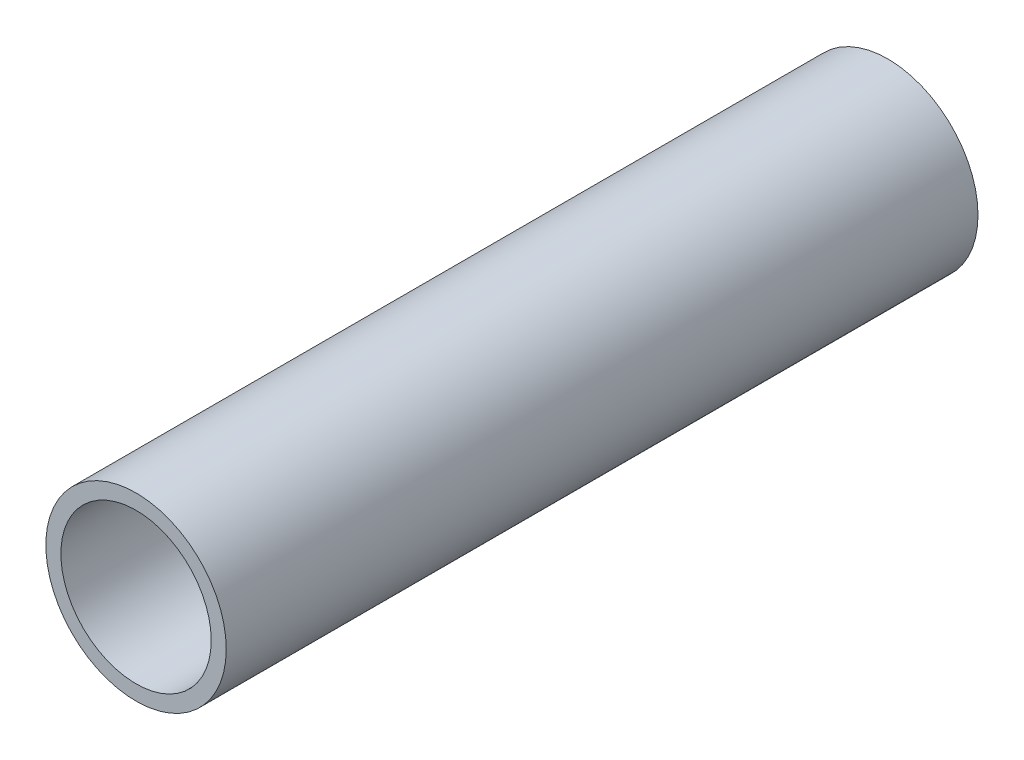
ISO-10303-21;
HEADER;
FILE_DESCRIPTION(('STEP AP214'),'2;1');
FILE_NAME('part.step','',(''),(''),'','','');
FILE_SCHEMA(('AUTOMOTIVE_DESIGN { 1 0 10303 214 1 1 1 1 }'));
ENDSEC;
DATA;
#1=APPLICATION_CONTEXT('core data for automotive mechanical design processes');
#2=APPLICATION_PROTOCOL_DEFINITION('international standard','automotive_design',2000,#1);
#3=PRODUCT_CONTEXT('',#1,'mechanical');
#4=PRODUCT('Part','Part','',(#3));
#5=PRODUCT_RELATED_PRODUCT_CATEGORY('part','',(#4));
#6=PRODUCT_DEFINITION_FORMATION('','',#4);
#7=PRODUCT_DEFINITION_CONTEXT('part definition',#1,'design');
#8=PRODUCT_DEFINITION('design','',#6,#7);
#9=PRODUCT_DEFINITION_SHAPE('','',#8);
#10=(LENGTH_UNIT() NAMED_UNIT(*) SI_UNIT(.MILLI.,.METRE.));
#11=(NAMED_UNIT(*) PLANE_ANGLE_UNIT() SI_UNIT($,.RADIAN.));
#12=(NAMED_UNIT(*) SI_UNIT($,.STERADIAN.) SOLID_ANGLE_UNIT());
#13=UNCERTAINTY_MEASURE_WITH_UNIT(LENGTH_MEASURE(1.E-05),#10,'distance_accuracy_value','');
#14=(GEOMETRIC_REPRESENTATION_CONTEXT(3) GLOBAL_UNCERTAINTY_ASSIGNED_CONTEXT((#13)) GLOBAL_UNIT_ASSIGNED_CONTEXT((#10,
#11,#12)) REPRESENTATION_CONTEXT('',''));
#15=CARTESIAN_POINT('',(0.,0.,0.));
#16=DIRECTION('',(0.,0.,1.));
#17=DIRECTION('',(1.,0.,0.));
#18=AXIS2_PLACEMENT_3D('',#15,#16,#17);
#19=CARTESIAN_POINT('',(0.,0.,500.));
#20=DIRECTION('',(0.,0.,1.));
#21=DIRECTION('',(1.,0.,0.));
#22=AXIS2_PLACEMENT_3D('',#19,#20,#21);
#23=PLANE('',#22);
#24=CARTESIAN_POINT('',(0.,0.,500.));
#25=DIRECTION('',(0.,0.,1.));
#26=DIRECTION('',(1.,0.,0.));
#27=AXIS2_PLACEMENT_3D('',#24,#25,#26);
#28=CIRCLE('',#27,60.);
#29=CARTESIAN_POINT('',(60.,0.,500.));
#30=VERTEX_POINT('',#29);
#31=EDGE_CURVE('E10',#30,#30,#28,.T.);
#32=ORIENTED_EDGE('',*,*,#31,.T.);
#33=EDGE_LOOP('',(#32));
#34=FACE_BOUND('',#33,.T.);
#35=CARTESIAN_POINT('',(0.,0.,500.));
#36=DIRECTION('',(0.,0.,1.));
#37=DIRECTION('',(1.,0.,0.));
#38=AXIS2_PLACEMENT_3D('',#35,#36,#37);
#39=CIRCLE('',#38,50.);
#40=CARTESIAN_POINT('',(50.,0.,500.));
#41=VERTEX_POINT('',#40);
#42=EDGE_CURVE('E50',#41,#41,#39,.T.);
#43=ORIENTED_EDGE('',*,*,#42,.F.);
#44=EDGE_LOOP('',(#43));
#45=FACE_BOUND('',#44,.T.);
#46=ADVANCED_FACE('F37',(#34,#45),#23,.T.);
#47=CARTESIAN_POINT('',(0.,0.,0.));
#48=DIRECTION('',(0.,0.,1.));
#49=DIRECTION('',(1.,0.,0.));
#50=AXIS2_PLACEMENT_3D('',#47,#48,#49);
#51=PLANE('',#50);
#52=CARTESIAN_POINT('',(0.,0.,0.));
#53=DIRECTION('',(0.,0.,1.));
#54=DIRECTION('',(1.,0.,0.));
#55=AXIS2_PLACEMENT_3D('',#52,#53,#54);
#56=CIRCLE('',#55,60.);
#57=CARTESIAN_POINT('',(60.,0.,0.));
#58=VERTEX_POINT('',#57);
#59=EDGE_CURVE('E41',#58,#58,#56,.T.);
#60=ORIENTED_EDGE('',*,*,#59,.F.);
#61=EDGE_LOOP('',(#60));
#62=FACE_BOUND('',#61,.T.);
#63=CARTESIAN_POINT('',(0.,0.,0.));
#64=DIRECTION('',(0.,0.,1.));
#65=DIRECTION('',(1.,0.,0.));
#66=AXIS2_PLACEMENT_3D('',#63,#64,#65);
#67=CIRCLE('',#66,50.);
#68=CARTESIAN_POINT('',(50.,0.,0.));
#69=VERTEX_POINT('',#68);
#70=EDGE_CURVE('E52',#69,#69,#67,.T.);
#71=ORIENTED_EDGE('',*,*,#70,.T.);
#72=EDGE_LOOP('',(#71));
#73=FACE_BOUND('',#72,.T.);
#74=ADVANCED_FACE('F64',(#62,#73),#51,.F.);
#75=CARTESIAN_POINT('',(0.,0.,500.));
#76=DIRECTION('',(0.,0.,-1.));
#77=DIRECTION('',(-1.,0.,0.));
#78=AXIS2_PLACEMENT_3D('',#75,#76,#77);
#79=CYLINDRICAL_SURFACE('',#78,60.);
#80=ORIENTED_EDGE('',*,*,#31,.F.);
#81=EDGE_LOOP('',(#80));
#82=FACE_BOUND('',#81,.T.);
#83=ORIENTED_EDGE('',*,*,#59,.T.);
#84=EDGE_LOOP('',(#83));
#85=FACE_BOUND('',#84,.T.);
#86=ADVANCED_FACE('F39',(#82,#85),#79,.T.);
#87=CARTESIAN_POINT('',(0.,0.,500.));
#88=DIRECTION('',(0.,0.,-1.));
#89=DIRECTION('',(-1.,0.,0.));
#90=AXIS2_PLACEMENT_3D('',#87,#88,#89);
#91=CYLINDRICAL_SURFACE('',#90,50.);
#92=ORIENTED_EDGE('',*,*,#42,.T.);
#93=EDGE_LOOP('',(#92));
#94=FACE_BOUND('',#93,.T.);
#95=ORIENTED_EDGE('',*,*,#70,.F.);
#96=EDGE_LOOP('',(#95));
#97=FACE_BOUND('',#96,.T.);
#98=ADVANCED_FACE('F60',(#94,#97),#91,.F.);
#99=CLOSED_SHELL('',(#46,#74,#86,#98));
#100=MANIFOLD_SOLID_BREP('B2',#99);
#101=ADVANCED_BREP_SHAPE_REPRESENTATION('',(#18,#100),#14);
#102=SHAPE_DEFINITION_REPRESENTATION(#9,#101);
ENDSEC;
END-ISO-10303-21;
